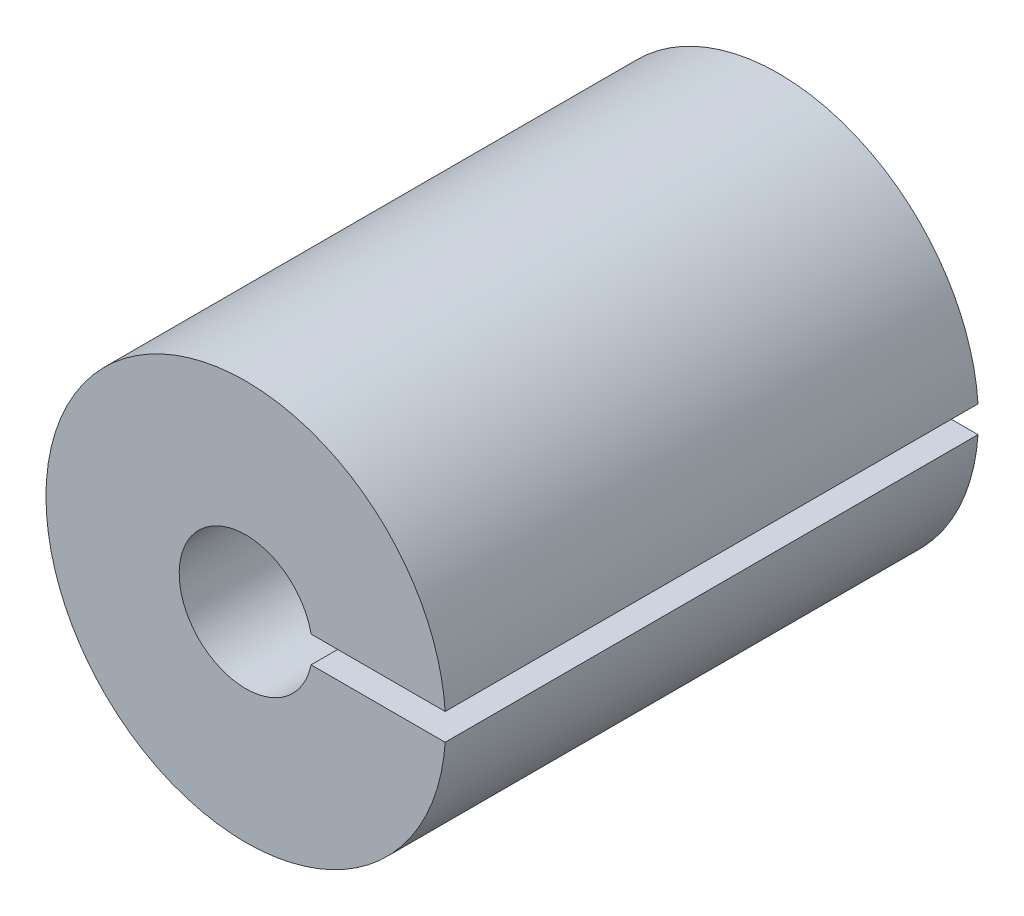
ISO-10303-21;
HEADER;
FILE_DESCRIPTION(('STEP AP214'),'2;1');
FILE_NAME('part.step','',(''),(''),'','','');
FILE_SCHEMA(('AUTOMOTIVE_DESIGN { 1 0 10303 214 1 1 1 1 }'));
ENDSEC;
DATA;
#1=APPLICATION_CONTEXT('core data for automotive mechanical design processes');
#2=APPLICATION_PROTOCOL_DEFINITION('international standard','automotive_design',2000,#1);
#3=PRODUCT_CONTEXT('',#1,'mechanical');
#4=PRODUCT('Part','Part','',(#3));
#5=PRODUCT_RELATED_PRODUCT_CATEGORY('part','',(#4));
#6=PRODUCT_DEFINITION_FORMATION('','',#4);
#7=PRODUCT_DEFINITION_CONTEXT('part definition',#1,'design');
#8=PRODUCT_DEFINITION('design','',#6,#7);
#9=PRODUCT_DEFINITION_SHAPE('','',#8);
#10=(LENGTH_UNIT() NAMED_UNIT(*) SI_UNIT(.MILLI.,.METRE.));
#11=(NAMED_UNIT(*) PLANE_ANGLE_UNIT() SI_UNIT($,.RADIAN.));
#12=(NAMED_UNIT(*) SI_UNIT($,.STERADIAN.) SOLID_ANGLE_UNIT());
#13=UNCERTAINTY_MEASURE_WITH_UNIT(LENGTH_MEASURE(1.E-05),#10,'distance_accuracy_value','');
#14=(GEOMETRIC_REPRESENTATION_CONTEXT(3) GLOBAL_UNCERTAINTY_ASSIGNED_CONTEXT((#13)) GLOBAL_UNIT_ASSIGNED_CONTEXT((#10,
#11,#12)) REPRESENTATION_CONTEXT('',''));
#15=CARTESIAN_POINT('',(0.,0.,0.));
#16=DIRECTION('',(0.,0.,1.));
#17=DIRECTION('',(1.,0.,0.));
#18=AXIS2_PLACEMENT_3D('',#15,#16,#17);
#19=CARTESIAN_POINT('',(2.643618726121,1.,-4.12));
#20=DIRECTION('',(0.,-1.,0.));
#21=DIRECTION('',(0.,0.,-1.));
#22=AXIS2_PLACEMENT_3D('',#19,#20,#21);
#23=PLANE('',#22);
#24=CARTESIAN_POINT('',(4.89897948557,1.,40.));
#25=CARTESIAN_POINT('',(4.89897948557,1.,20.));
#26=(BOUNDED_CURVE() B_SPLINE_CURVE(1,(#24,#25),.UNSPECIFIED.,.F.,
.F.) B_SPLINE_CURVE_WITH_KNOTS((2,2),(-20.,0.),
.UNSPECIFIED.) CURVE() GEOMETRIC_REPRESENTATION_ITEM() RATIONAL_B_SPLINE_CURVE((1.,1.)) REPRESENTATION_ITEM(''));
#27=CARTESIAN_POINT('',(4.89897948557,1.,40.));
#28=VERTEX_POINT('',#27);
#29=CARTESIAN_POINT('',(4.89897948557,1.,20.));
#30=VERTEX_POINT('',#29);
#31=EDGE_CURVE('E77',#28,#30,#26,.T.);
#32=ORIENTED_EDGE('',*,*,#31,.T.);
#33=CARTESIAN_POINT('',(3.87298334621,1.,20.));
#34=CARTESIAN_POINT('',(4.89897948557,1.,20.));
#35=(BOUNDED_CURVE() B_SPLINE_CURVE(1,(#33,#34),.UNSPECIFIED.,.F.,
.F.) B_SPLINE_CURVE_WITH_KNOTS((2,2),(0.,1.02599613936),
.UNSPECIFIED.) CURVE() GEOMETRIC_REPRESENTATION_ITEM() RATIONAL_B_SPLINE_CURVE((1.,1.)) REPRESENTATION_ITEM(''));
#36=CARTESIAN_POINT('',(3.87298334621,1.,20.));
#37=VERTEX_POINT('',#36);
#38=EDGE_CURVE('E23',#37,#30,#35,.T.);
#39=ORIENTED_EDGE('',*,*,#38,.F.);
#40=CARTESIAN_POINT('',(3.87298334621,1.,20.));
#41=CARTESIAN_POINT('',(3.87298334621,1.,0.));
#42=(BOUNDED_CURVE() B_SPLINE_CURVE(1,(#40,#41),.UNSPECIFIED.,.F.,
.F.) B_SPLINE_CURVE_WITH_KNOTS((2,2),(-20.,0.),
.UNSPECIFIED.) CURVE() GEOMETRIC_REPRESENTATION_ITEM() RATIONAL_B_SPLINE_CURVE((1.,1.)) REPRESENTATION_ITEM(''));
#43=CARTESIAN_POINT('',(3.87298334621,1.,0.));
#44=VERTEX_POINT('',#43);
#45=EDGE_CURVE('E122',#37,#44,#42,.T.);
#46=ORIENTED_EDGE('',*,*,#45,.T.);
#47=CARTESIAN_POINT('',(3.87298334621,1.,0.));
#48=CARTESIAN_POINT('',(14.9666295471,1.,0.));
#49=(BOUNDED_CURVE() B_SPLINE_CURVE(1,(#47,#48),.UNSPECIFIED.,.F.,
.F.) B_SPLINE_CURVE_WITH_KNOTS((2,2),(-11.09364620089,0.),
.UNSPECIFIED.) CURVE() GEOMETRIC_REPRESENTATION_ITEM() RATIONAL_B_SPLINE_CURVE((1.,1.)) REPRESENTATION_ITEM(''));
#50=CARTESIAN_POINT('',(14.9666295471,1.,0.));
#51=VERTEX_POINT('',#50);
#52=EDGE_CURVE('E161',#44,#51,#49,.T.);
#53=ORIENTED_EDGE('',*,*,#52,.T.);
#54=CARTESIAN_POINT('',(14.9666295471,1.,40.));
#55=CARTESIAN_POINT('',(14.9666295471,1.,0.));
#56=(BOUNDED_CURVE() B_SPLINE_CURVE(1,(#54,#55),.UNSPECIFIED.,.F.,
.F.) B_SPLINE_CURVE_WITH_KNOTS((2,2),(0.,40.),
.UNSPECIFIED.) CURVE() GEOMETRIC_REPRESENTATION_ITEM() RATIONAL_B_SPLINE_CURVE((1.,1.)) REPRESENTATION_ITEM(''));
#57=CARTESIAN_POINT('',(14.9666295471,1.,40.));
#58=VERTEX_POINT('',#57);
#59=EDGE_CURVE('E32',#58,#51,#56,.T.);
#60=ORIENTED_EDGE('',*,*,#59,.F.);
#61=CARTESIAN_POINT('',(4.89897948557,1.,40.));
#62=CARTESIAN_POINT('',(14.9666295471,1.,40.));
#63=(BOUNDED_CURVE() B_SPLINE_CURVE(1,(#61,#62),.UNSPECIFIED.,.F.,
.F.) B_SPLINE_CURVE_WITH_KNOTS((2,2),(0.,10.06765006153),
.UNSPECIFIED.) CURVE() GEOMETRIC_REPRESENTATION_ITEM() RATIONAL_B_SPLINE_CURVE((1.,1.)) REPRESENTATION_ITEM(''));
#64=EDGE_CURVE('E305',#28,#58,#63,.T.);
#65=ORIENTED_EDGE('',*,*,#64,.F.);
#66=EDGE_LOOP('',(#32,#39,#46,#53,#60,#65));
#67=FACE_BOUND('',#66,.T.);
#68=ADVANCED_FACE('F19',(#67),#23,.T.);
#69=CARTESIAN_POINT('',(16.195994167189,-1.,-4.12));
#70=DIRECTION('',(0.,1.,0.));
#71=DIRECTION('',(1.,0.,0.));
#72=AXIS2_PLACEMENT_3D('',#69,#70,#71);
#73=PLANE('',#72);
#74=CARTESIAN_POINT('',(14.9666295471,-1.,0.));
#75=CARTESIAN_POINT('',(14.9666295471,-1.,40.));
#76=(BOUNDED_CURVE() B_SPLINE_CURVE(1,(#74,#75),.UNSPECIFIED.,.F.,
.F.) B_SPLINE_CURVE_WITH_KNOTS((2,2),(0.,40.),
.UNSPECIFIED.) CURVE() GEOMETRIC_REPRESENTATION_ITEM() RATIONAL_B_SPLINE_CURVE((1.,1.)) REPRESENTATION_ITEM(''));
#77=CARTESIAN_POINT('',(14.9666295471,-1.,0.));
#78=VERTEX_POINT('',#77);
#79=CARTESIAN_POINT('',(14.9666295471,-1.,40.));
#80=VERTEX_POINT('',#79);
#81=EDGE_CURVE('E11',#78,#80,#76,.T.);
#82=ORIENTED_EDGE('',*,*,#81,.F.);
#83=CARTESIAN_POINT('',(14.9666295471,-1.,0.));
#84=CARTESIAN_POINT('',(3.87298334621,-1.,0.));
#85=(BOUNDED_CURVE() B_SPLINE_CURVE(1,(#83,#84),.UNSPECIFIED.,.F.,
.F.) B_SPLINE_CURVE_WITH_KNOTS((2,2),(-11.09364620089,0.),
.UNSPECIFIED.) CURVE() GEOMETRIC_REPRESENTATION_ITEM() RATIONAL_B_SPLINE_CURVE((1.,1.)) REPRESENTATION_ITEM(''));
#86=CARTESIAN_POINT('',(3.87298334621,-1.,0.));
#87=VERTEX_POINT('',#86);
#88=EDGE_CURVE('E116',#78,#87,#85,.T.);
#89=ORIENTED_EDGE('',*,*,#88,.T.);
#90=CARTESIAN_POINT('',(3.87298334621,-1.,0.));
#91=CARTESIAN_POINT('',(3.87298334621,-1.,20.));
#92=(BOUNDED_CURVE() B_SPLINE_CURVE(1,(#90,#91),.UNSPECIFIED.,.F.,
.F.) B_SPLINE_CURVE_WITH_KNOTS((2,2),(-20.,0.),
.UNSPECIFIED.) CURVE() GEOMETRIC_REPRESENTATION_ITEM() RATIONAL_B_SPLINE_CURVE((1.,1.)) REPRESENTATION_ITEM(''));
#93=CARTESIAN_POINT('',(3.87298334621,-1.,20.));
#94=VERTEX_POINT('',#93);
#95=EDGE_CURVE('E113',#87,#94,#92,.T.);
#96=ORIENTED_EDGE('',*,*,#95,.T.);
#97=CARTESIAN_POINT('',(4.89897948557,-1.,20.));
#98=CARTESIAN_POINT('',(3.87298334621,-1.,20.));
#99=(BOUNDED_CURVE() B_SPLINE_CURVE(1,(#97,#98),.UNSPECIFIED.,.F.,
.F.) B_SPLINE_CURVE_WITH_KNOTS((2,2),(0.,1.02599613936),
.UNSPECIFIED.) CURVE() GEOMETRIC_REPRESENTATION_ITEM() RATIONAL_B_SPLINE_CURVE((1.,1.)) REPRESENTATION_ITEM(''));
#100=CARTESIAN_POINT('',(4.89897948557,-1.,20.));
#101=VERTEX_POINT('',#100);
#102=EDGE_CURVE('E101',#101,#94,#99,.T.);
#103=ORIENTED_EDGE('',*,*,#102,.F.);
#104=CARTESIAN_POINT('',(4.89897948557,-1.,20.));
#105=CARTESIAN_POINT('',(4.89897948557,-1.,40.));
#106=(BOUNDED_CURVE() B_SPLINE_CURVE(1,(#104,#105),.UNSPECIFIED.,.F.,
.F.) B_SPLINE_CURVE_WITH_KNOTS((2,2),(-20.,0.),
.UNSPECIFIED.) CURVE() GEOMETRIC_REPRESENTATION_ITEM() RATIONAL_B_SPLINE_CURVE((1.,1.)) REPRESENTATION_ITEM(''));
#107=CARTESIAN_POINT('',(4.89897948557,-1.,40.));
#108=VERTEX_POINT('',#107);
#109=EDGE_CURVE('E65',#101,#108,#106,.T.);
#110=ORIENTED_EDGE('',*,*,#109,.T.);
#111=CARTESIAN_POINT('',(14.9666295471,-1.,40.));
#112=CARTESIAN_POINT('',(4.89897948557,-1.,40.));
#113=(BOUNDED_CURVE() B_SPLINE_CURVE(1,(#111,#112),.UNSPECIFIED.,.F.,
.F.) B_SPLINE_CURVE_WITH_KNOTS((2,2),(0.,10.06765006153),
.UNSPECIFIED.) CURVE() GEOMETRIC_REPRESENTATION_ITEM() RATIONAL_B_SPLINE_CURVE((1.,1.)) REPRESENTATION_ITEM(''));
#114=EDGE_CURVE('E135',#80,#108,#113,.T.);
#115=ORIENTED_EDGE('',*,*,#114,.F.);
#116=EDGE_LOOP('',(#82,#89,#96,#103,#110,#115));
#117=FACE_BOUND('',#116,.T.);
#118=ADVANCED_FACE('F114',(#117),#73,.T.);
#119=CARTESIAN_POINT('',(0.,0.,20.));
#120=DIRECTION('',(0.,0.,1.));
#121=DIRECTION('',(1.,0.,0.));
#122=AXIS2_PLACEMENT_3D('',#119,#120,#121);
#123=CYLINDRICAL_SURFACE('',#122,15.);
#124=CARTESIAN_POINT('',(14.9666295471,1.,40.));
#125=CARTESIAN_POINT('',(13.999443361362,15.47551734593,40.));
#126=CARTESIAN_POINT('',(-0.500278320267192,14.9916550664593,40.));
#127=CARTESIAN_POINT('',(-15.0000000018964,14.5077927869887,40.));
#128=CARTESIAN_POINT('',(-15.0000000018964,0.,40.));
#129=CARTESIAN_POINT('',(-15.0000000018964,-14.5077927869887,40.));
#130=CARTESIAN_POINT('',(-0.500278320267216,-14.9916550664593,40.));
#131=CARTESIAN_POINT('',(13.9994433613619,-15.4755173459299,40.));
#132=CARTESIAN_POINT('',(14.9666295471,-1.,40.));
#133=(BOUNDED_CURVE() B_SPLINE_CURVE(2,(#124,#125,#126,#127,#128,#129,#130,#131,#132),
.UNSPECIFIED.,.F.,.F.) B_SPLINE_CURVE_WITH_KNOTS((3,2,2,2,3),(0.,23.0615737903379,
46.1231475806757,69.1847213710136,92.2462951613515),
.UNSPECIFIED.) CURVE() GEOMETRIC_REPRESENTATION_ITEM() RATIONAL_B_SPLINE_CURVE((1.,
0.718801741773266,1.,0.718801741773266,1.,0.718801741773266,1.,0.718801741773266,1.)) REPRESENTATION_ITEM(''));
#134=EDGE_CURVE('E297',#58,#80,#133,.T.);
#135=ORIENTED_EDGE('',*,*,#134,.F.);
#136=ORIENTED_EDGE('',*,*,#59,.T.);
#137=CARTESIAN_POINT('',(14.9666295471,1.,0.));
#138=CARTESIAN_POINT('',(13.999443361362,15.47551734593,0.));
#139=CARTESIAN_POINT('',(-0.500278320267192,14.9916550664593,0.));
#140=CARTESIAN_POINT('',(-15.0000000018964,14.5077927869887,0.));
#141=CARTESIAN_POINT('',(-15.0000000018964,0.,0.));
#142=CARTESIAN_POINT('',(-15.0000000018964,-14.5077927869887,0.));
#143=CARTESIAN_POINT('',(-0.500278320267216,-14.9916550664593,0.));
#144=CARTESIAN_POINT('',(13.9994433613619,-15.4755173459299,0.));
#145=CARTESIAN_POINT('',(14.9666295471,-1.,0.));
#146=(BOUNDED_CURVE() B_SPLINE_CURVE(2,(#137,#138,#139,#140,#141,#142,#143,#144,#145),
.UNSPECIFIED.,.F.,.F.) B_SPLINE_CURVE_WITH_KNOTS((3,2,2,2,3),(-92.2462951613515,
-69.1847213710136,-46.1231475806757,-23.0615737903379,0.),
.UNSPECIFIED.) CURVE() GEOMETRIC_REPRESENTATION_ITEM() RATIONAL_B_SPLINE_CURVE((1.,
0.718801741773266,1.,0.718801741773266,1.,0.718801741773266,1.,0.718801741773266,1.)) REPRESENTATION_ITEM(''));
#147=EDGE_CURVE('E169',#51,#78,#146,.T.);
#148=ORIENTED_EDGE('',*,*,#147,.T.);
#149=ORIENTED_EDGE('',*,*,#81,.T.);
#150=EDGE_LOOP('',(#135,#136,#148,#149));
#151=FACE_BOUND('',#150,.T.);
#152=ADVANCED_FACE('F196',(#151),#123,.T.);
#153=CARTESIAN_POINT('',(-18.116662956796,-18.6906208151159,40.));
#154=DIRECTION('',(0.,0.,1.));
#155=DIRECTION('',(1.,0.,0.));
#156=AXIS2_PLACEMENT_3D('',#153,#154,#155);
#157=PLANE('',#156);
#158=ORIENTED_EDGE('',*,*,#134,.T.);
#159=ORIENTED_EDGE('',*,*,#114,.T.);
#160=CARTESIAN_POINT('',(4.89897948557,-1.,40.));
#161=CARTESIAN_POINT('',(3.99491037994991,-5.42901600204954,40.));
#162=CARTESIAN_POINT('',(-0.502544810113427,-4.97468076511537,40.));
#163=CARTESIAN_POINT('',(-5.00000000017676,-4.52034552818119,40.));
#164=CARTESIAN_POINT('',(-5.00000000017676,0.,40.));
#165=CARTESIAN_POINT('',(-5.00000000017676,4.52034552818119,40.));
#166=CARTESIAN_POINT('',(-0.502544810113427,4.97468076511537,40.));
#167=CARTESIAN_POINT('',(3.99491037994991,5.42901600204954,40.));
#168=CARTESIAN_POINT('',(4.89897948557,1.,40.));
#169=(BOUNDED_CURVE() B_SPLINE_CURVE(2,(#160,#161,#162,#163,#164,#165,#166,#167,#168),
.UNSPECIFIED.,.F.,.F.) B_SPLINE_CURVE_WITH_KNOTS((3,2,2,2,3),(-29.4023473285561,
-22.0517604964171,-14.701173664278,-7.35058683213902,0.),
.UNSPECIFIED.) CURVE() GEOMETRIC_REPRESENTATION_ITEM() RATIONAL_B_SPLINE_CURVE((1.,
0.74179139992433,1.,0.74179139992433,1.,0.74179139992433,1.,0.74179139992433,1.)) REPRESENTATION_ITEM(''));
#170=EDGE_CURVE('E144',#108,#28,#169,.T.);
#171=ORIENTED_EDGE('',*,*,#170,.T.);
#172=ORIENTED_EDGE('',*,*,#64,.T.);
#173=EDGE_LOOP('',(#158,#159,#171,#172));
#174=FACE_BOUND('',#173,.T.);
#175=ADVANCED_FACE('F214',(#174),#157,.T.);
#176=CARTESIAN_POINT('',(0.,0.,30.));
#177=DIRECTION('',(0.,0.,1.));
#178=DIRECTION('',(1.,0.,0.));
#179=AXIS2_PLACEMENT_3D('',#176,#177,#178);
#180=CYLINDRICAL_SURFACE('',#179,5.);
#181=CARTESIAN_POINT('',(4.89897948557,1.,20.));
#182=CARTESIAN_POINT('',(3.99491037994991,5.42901600204954,20.));
#183=CARTESIAN_POINT('',(-0.502544810113427,4.97468076511537,20.));
#184=CARTESIAN_POINT('',(-5.00000000017676,4.52034552818119,20.));
#185=CARTESIAN_POINT('',(-5.00000000017676,0.,20.));
#186=CARTESIAN_POINT('',(-5.00000000017676,-4.52034552818119,20.));
#187=CARTESIAN_POINT('',(-0.502544810113427,-4.97468076511537,20.));
#188=CARTESIAN_POINT('',(3.99491037994991,-5.42901600204954,20.));
#189=CARTESIAN_POINT('',(4.89897948557,-1.,20.));
#190=(BOUNDED_CURVE() B_SPLINE_CURVE(2,(#181,#182,#183,#184,#185,#186,#187,#188,#189),
.UNSPECIFIED.,.F.,.F.) B_SPLINE_CURVE_WITH_KNOTS((3,2,2,2,3),(-29.4023473285561,
-22.0517604964171,-14.701173664278,-7.35058683213902,0.),
.UNSPECIFIED.) CURVE() GEOMETRIC_REPRESENTATION_ITEM() RATIONAL_B_SPLINE_CURVE((1.,
0.74179139992433,1.,0.74179139992433,1.,0.74179139992433,1.,0.74179139992433,1.)) REPRESENTATION_ITEM(''));
#191=EDGE_CURVE('E107',#30,#101,#190,.T.);
#192=ORIENTED_EDGE('',*,*,#191,.F.);
#193=ORIENTED_EDGE('',*,*,#31,.F.);
#194=ORIENTED_EDGE('',*,*,#170,.F.);
#195=ORIENTED_EDGE('',*,*,#109,.F.);
#196=EDGE_LOOP('',(#192,#193,#194,#195));
#197=FACE_BOUND('',#196,.T.);
#198=ADVANCED_FACE('F220',(#197),#180,.F.);
#199=CARTESIAN_POINT('',(-6.10989794875144,-6.63481920245945,20.));
#200=DIRECTION('',(0.,0.,1.));
#201=DIRECTION('',(1.,0.,0.));
#202=AXIS2_PLACEMENT_3D('',#199,#200,#201);
#203=PLANE('',#202);
#204=ORIENTED_EDGE('',*,*,#191,.T.);
#205=ORIENTED_EDGE('',*,*,#102,.T.);
#206=CARTESIAN_POINT('',(3.87298334621,-1.,20.));
#207=CARTESIAN_POINT('',(2.99196566013961,-4.4121668259012,20.));
#208=CARTESIAN_POINT('',(-0.504017169969558,-3.968118785109,20.));
#209=CARTESIAN_POINT('',(-4.00000000007873,-3.52407074431679,20.));
#210=CARTESIAN_POINT('',(-4.00000000007873,0.,20.));
#211=CARTESIAN_POINT('',(-4.00000000007873,3.52407074431679,20.));
#212=CARTESIAN_POINT('',(-0.504017169969559,3.968118785109,20.));
#213=CARTESIAN_POINT('',(2.99196566013961,4.4121668259012,20.));
#214=CARTESIAN_POINT('',(3.87298334621,1.,20.));
#215=(BOUNDED_CURVE() B_SPLINE_CURVE(2,(#206,#207,#208,#209,#210,#211,#212,#213,#214),
.UNSPECIFIED.,.F.,.F.) B_SPLINE_CURVE_WITH_KNOTS((3,2,2,2,3),(-23.1112991878335,
-17.3334743908751,-11.5556495939167,-5.77782479695837,0.),
.UNSPECIFIED.) CURVE() GEOMETRIC_REPRESENTATION_ITEM() RATIONAL_B_SPLINE_CURVE((1.,
0.750334689482449,1.,0.750334689482449,1.,0.750334689482449,1.,0.750334689482449,1.)) REPRESENTATION_ITEM(''));
#216=EDGE_CURVE('E105',#94,#37,#215,.T.);
#217=ORIENTED_EDGE('',*,*,#216,.T.);
#218=ORIENTED_EDGE('',*,*,#38,.T.);
#219=EDGE_LOOP('',(#204,#205,#217,#218));
#220=FACE_BOUND('',#219,.T.);
#221=ADVANCED_FACE('F103',(#220),#203,.T.);
#222=CARTESIAN_POINT('',(-18.116662956796,-18.6906208151159,0.));
#223=DIRECTION('',(0.,0.,-1.));
#224=DIRECTION('',(0.,-1.,0.));
#225=AXIS2_PLACEMENT_3D('',#222,#223,#224);
#226=PLANE('',#225);
#227=CARTESIAN_POINT('',(3.87298334621,1.,0.));
#228=CARTESIAN_POINT('',(2.99196566013961,4.41216682590121,0.));
#229=CARTESIAN_POINT('',(-0.504017169969559,3.968118785109,0.));
#230=CARTESIAN_POINT('',(-4.00000000007873,3.52407074431679,0.));
#231=CARTESIAN_POINT('',(-4.00000000007873,0.,0.));
#232=CARTESIAN_POINT('',(-4.00000000007873,-3.52407074431679,0.));
#233=CARTESIAN_POINT('',(-0.504017169969558,-3.968118785109,0.));
#234=CARTESIAN_POINT('',(2.99196566013961,-4.4121668259012,0.));
#235=CARTESIAN_POINT('',(3.87298334621,-1.,0.));
#236=(BOUNDED_CURVE() B_SPLINE_CURVE(2,(#227,#228,#229,#230,#231,#232,#233,#234,#235),
.UNSPECIFIED.,.F.,.F.) B_SPLINE_CURVE_WITH_KNOTS((3,2,2,2,3),(-23.1112991878335,
-17.3334743908751,-11.5556495939167,-5.77782479695837,0.),
.UNSPECIFIED.) CURVE() GEOMETRIC_REPRESENTATION_ITEM() RATIONAL_B_SPLINE_CURVE((1.,
0.750334689482449,1.,0.750334689482449,1.,0.750334689482449,1.,0.750334689482449,1.)) REPRESENTATION_ITEM(''));
#237=EDGE_CURVE('E129',#44,#87,#236,.T.);
#238=ORIENTED_EDGE('',*,*,#237,.T.);
#239=ORIENTED_EDGE('',*,*,#88,.F.);
#240=ORIENTED_EDGE('',*,*,#147,.F.);
#241=ORIENTED_EDGE('',*,*,#52,.F.);
#242=EDGE_LOOP('',(#238,#239,#240,#241));
#243=FACE_BOUND('',#242,.T.);
#244=ADVANCED_FACE('F233',(#243),#226,.T.);
#245=CARTESIAN_POINT('',(0.,0.,10.));
#246=DIRECTION('',(0.,0.,1.));
#247=DIRECTION('',(1.,0.,0.));
#248=AXIS2_PLACEMENT_3D('',#245,#246,#247);
#249=CYLINDRICAL_SURFACE('',#248,4.);
#250=ORIENTED_EDGE('',*,*,#237,.F.);
#251=ORIENTED_EDGE('',*,*,#45,.F.);
#252=ORIENTED_EDGE('',*,*,#216,.F.);
#253=ORIENTED_EDGE('',*,*,#95,.F.);
#254=EDGE_LOOP('',(#250,#251,#252,#253));
#255=FACE_BOUND('',#254,.T.);
#256=ADVANCED_FACE('F21',(#255),#249,.F.);
#257=CLOSED_SHELL('',(#68,#118,#152,#175,#198,#221,#244,#256));
#258=MANIFOLD_SOLID_BREP('B1',#257);
#259=ADVANCED_BREP_SHAPE_REPRESENTATION('',(#18,#258),#14);
#260=SHAPE_DEFINITION_REPRESENTATION(#9,#259);
ENDSEC;
END-ISO-10303-21;
